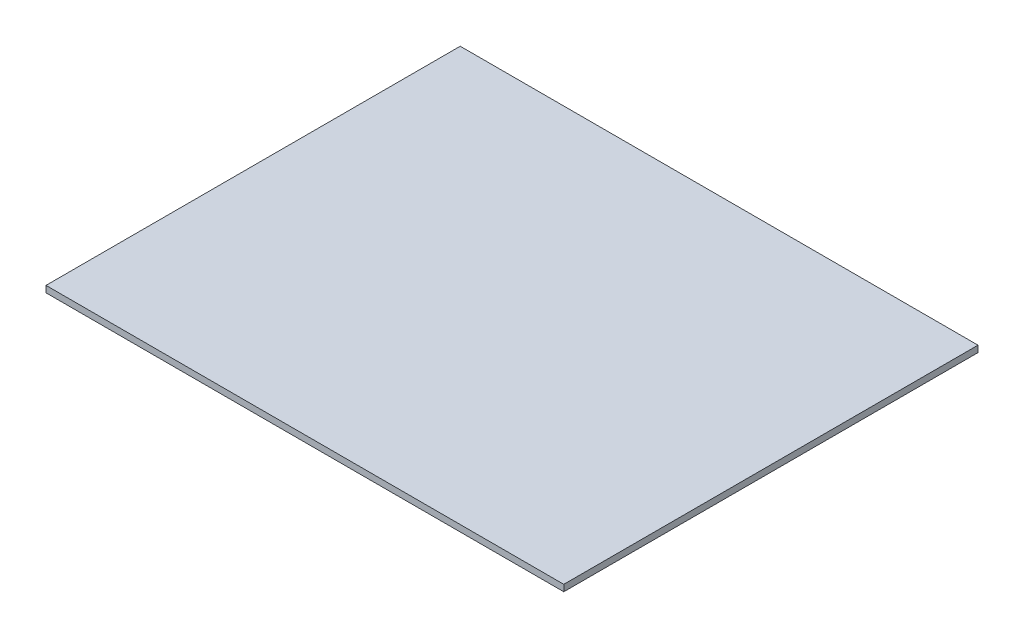
ISO-10303-21;
HEADER;
FILE_DESCRIPTION(('STEP AP214'),'2;1');
FILE_NAME('part.step','',(''),(''),'','','');
FILE_SCHEMA(('AUTOMOTIVE_DESIGN { 1 0 10303 214 1 1 1 1 }'));
ENDSEC;
DATA;
#1=APPLICATION_CONTEXT('core data for automotive mechanical design processes');
#2=APPLICATION_PROTOCOL_DEFINITION('international standard','automotive_design',2000,#1);
#3=PRODUCT_CONTEXT('',#1,'mechanical');
#4=PRODUCT('Part','Part','',(#3));
#5=PRODUCT_RELATED_PRODUCT_CATEGORY('part','',(#4));
#6=PRODUCT_DEFINITION_FORMATION('','',#4);
#7=PRODUCT_DEFINITION_CONTEXT('part definition',#1,'design');
#8=PRODUCT_DEFINITION('design','',#6,#7);
#9=PRODUCT_DEFINITION_SHAPE('','',#8);
#10=(LENGTH_UNIT() NAMED_UNIT(*) SI_UNIT(.MILLI.,.METRE.));
#11=(NAMED_UNIT(*) PLANE_ANGLE_UNIT() SI_UNIT($,.RADIAN.));
#12=(NAMED_UNIT(*) SI_UNIT($,.STERADIAN.) SOLID_ANGLE_UNIT());
#13=UNCERTAINTY_MEASURE_WITH_UNIT(LENGTH_MEASURE(1.E-05),#10,'distance_accuracy_value','');
#14=(GEOMETRIC_REPRESENTATION_CONTEXT(3) GLOBAL_UNCERTAINTY_ASSIGNED_CONTEXT((#13)) GLOBAL_UNIT_ASSIGNED_CONTEXT((#10,
#11,#12)) REPRESENTATION_CONTEXT('',''));
#15=CARTESIAN_POINT('',(0.,0.,0.));
#16=DIRECTION('',(0.,0.,1.));
#17=DIRECTION('',(1.,0.,0.));
#18=AXIS2_PLACEMENT_3D('',#15,#16,#17);
#19=CARTESIAN_POINT('',(0.,50.,0.));
#20=DIRECTION('',(1.,0.,0.));
#21=DIRECTION('',(0.,0.,-1.));
#22=AXIS2_PLACEMENT_3D('',#19,#20,#21);
#23=PLANE('',#22);
#24=DIRECTION('',(0.,0.,1.));
#25=VECTOR('',#24,1.);
#26=CARTESIAN_POINT('',(0.,0.,0.));
#27=LINE('',#26,#25);
#28=CARTESIAN_POINT('',(0.,0.,-3200.));
#29=VERTEX_POINT('',#28);
#30=CARTESIAN_POINT('',(0.,0.,0.));
#31=VERTEX_POINT('',#30);
#32=EDGE_CURVE('E98',#29,#31,#27,.T.);
#33=ORIENTED_EDGE('',*,*,#32,.T.);
#34=DIRECTION('',(0.,-1.,0.));
#35=VECTOR('',#34,1.);
#36=CARTESIAN_POINT('',(0.,50.,0.));
#37=LINE('',#36,#35);
#38=CARTESIAN_POINT('',(0.,50.,0.));
#39=VERTEX_POINT('',#38);
#40=EDGE_CURVE('E11',#39,#31,#37,.T.);
#41=ORIENTED_EDGE('',*,*,#40,.F.);
#42=DIRECTION('',(0.,0.,1.));
#43=VECTOR('',#42,1.);
#44=CARTESIAN_POINT('',(0.,50.,0.));
#45=LINE('',#44,#43);
#46=CARTESIAN_POINT('',(0.,50.,-3200.));
#47=VERTEX_POINT('',#46);
#48=EDGE_CURVE('E86',#47,#39,#45,.T.);
#49=ORIENTED_EDGE('',*,*,#48,.F.);
#50=DIRECTION('',(0.,-1.,0.));
#51=VECTOR('',#50,1.);
#52=CARTESIAN_POINT('',(0.,50.,-3200.));
#53=LINE('',#52,#51);
#54=EDGE_CURVE('E94',#47,#29,#53,.T.);
#55=ORIENTED_EDGE('',*,*,#54,.T.);
#56=EDGE_LOOP('',(#33,#41,#49,#55));
#57=FACE_BOUND('',#56,.T.);
#58=ADVANCED_FACE('F35',(#57),#23,.F.);
#59=CARTESIAN_POINT('',(0.,50.,0.));
#60=DIRECTION('',(0.,0.,-1.));
#61=DIRECTION('',(-1.,0.,0.));
#62=AXIS2_PLACEMENT_3D('',#59,#60,#61);
#63=PLANE('',#62);
#64=DIRECTION('',(1.,0.,0.));
#65=VECTOR('',#64,1.);
#66=CARTESIAN_POINT('',(0.,0.,0.));
#67=LINE('',#66,#65);
#68=CARTESIAN_POINT('',(4000.,0.,0.));
#69=VERTEX_POINT('',#68);
#70=EDGE_CURVE('E90',#31,#69,#67,.T.);
#71=ORIENTED_EDGE('',*,*,#70,.T.);
#72=DIRECTION('',(0.,-1.,0.));
#73=VECTOR('',#72,1.);
#74=CARTESIAN_POINT('',(4000.,50.,0.));
#75=LINE('',#74,#73);
#76=CARTESIAN_POINT('',(4000.,50.,0.));
#77=VERTEX_POINT('',#76);
#78=EDGE_CURVE('E43',#77,#69,#75,.T.);
#79=ORIENTED_EDGE('',*,*,#78,.F.);
#80=DIRECTION('',(1.,0.,0.));
#81=VECTOR('',#80,1.);
#82=CARTESIAN_POINT('',(0.,50.,0.));
#83=LINE('',#82,#81);
#84=EDGE_CURVE('E81',#39,#77,#83,.T.);
#85=ORIENTED_EDGE('',*,*,#84,.F.);
#86=ORIENTED_EDGE('',*,*,#40,.T.);
#87=EDGE_LOOP('',(#71,#79,#85,#86));
#88=FACE_BOUND('',#87,.T.);
#89=ADVANCED_FACE('F89',(#88),#63,.F.);
#90=CARTESIAN_POINT('',(4000.,50.,0.));
#91=DIRECTION('',(-1.,0.,0.));
#92=DIRECTION('',(0.,0.,1.));
#93=AXIS2_PLACEMENT_3D('',#90,#91,#92);
#94=PLANE('',#93);
#95=DIRECTION('',(0.,0.,-1.));
#96=VECTOR('',#95,1.);
#97=CARTESIAN_POINT('',(4000.,0.,0.));
#98=LINE('',#97,#96);
#99=CARTESIAN_POINT('',(4000.,0.,-3200.));
#100=VERTEX_POINT('',#99);
#101=EDGE_CURVE('E68',#69,#100,#98,.T.);
#102=ORIENTED_EDGE('',*,*,#101,.T.);
#103=DIRECTION('',(0.,-1.,0.));
#104=VECTOR('',#103,1.);
#105=CARTESIAN_POINT('',(4000.,50.,-3200.));
#106=LINE('',#105,#104);
#107=CARTESIAN_POINT('',(4000.,50.,-3200.));
#108=VERTEX_POINT('',#107);
#109=EDGE_CURVE('E91',#108,#100,#106,.T.);
#110=ORIENTED_EDGE('',*,*,#109,.F.);
#111=DIRECTION('',(0.,0.,-1.));
#112=VECTOR('',#111,1.);
#113=CARTESIAN_POINT('',(4000.,50.,0.));
#114=LINE('',#113,#112);
#115=EDGE_CURVE('E84',#77,#108,#114,.T.);
#116=ORIENTED_EDGE('',*,*,#115,.F.);
#117=ORIENTED_EDGE('',*,*,#78,.T.);
#118=EDGE_LOOP('',(#102,#110,#116,#117));
#119=FACE_BOUND('',#118,.T.);
#120=ADVANCED_FACE('F92',(#119),#94,.F.);
#121=CARTESIAN_POINT('',(0.,50.,-3200.));
#122=DIRECTION('',(0.,0.,1.));
#123=DIRECTION('',(1.,0.,0.));
#124=AXIS2_PLACEMENT_3D('',#121,#122,#123);
#125=PLANE('',#124);
#126=DIRECTION('',(-1.,0.,0.));
#127=VECTOR('',#126,1.);
#128=CARTESIAN_POINT('',(0.,0.,-3200.));
#129=LINE('',#128,#127);
#130=EDGE_CURVE('E74',#100,#29,#129,.T.);
#131=ORIENTED_EDGE('',*,*,#130,.T.);
#132=ORIENTED_EDGE('',*,*,#54,.F.);
#133=DIRECTION('',(-1.,0.,0.));
#134=VECTOR('',#133,1.);
#135=CARTESIAN_POINT('',(0.,50.,-3200.));
#136=LINE('',#135,#134);
#137=EDGE_CURVE('E51',#108,#47,#136,.T.);
#138=ORIENTED_EDGE('',*,*,#137,.F.);
#139=ORIENTED_EDGE('',*,*,#109,.T.);
#140=EDGE_LOOP('',(#131,#132,#138,#139));
#141=FACE_BOUND('',#140,.T.);
#142=ADVANCED_FACE('F105',(#141),#125,.F.);
#143=CARTESIAN_POINT('',(0.,50.,0.));
#144=DIRECTION('',(0.,-1.,0.));
#145=DIRECTION('',(0.,0.,-1.));
#146=AXIS2_PLACEMENT_3D('',#143,#144,#145);
#147=PLANE('',#146);
#148=ORIENTED_EDGE('',*,*,#48,.T.);
#149=ORIENTED_EDGE('',*,*,#84,.T.);
#150=ORIENTED_EDGE('',*,*,#115,.T.);
#151=ORIENTED_EDGE('',*,*,#137,.T.);
#152=EDGE_LOOP('',(#148,#149,#150,#151));
#153=FACE_BOUND('',#152,.T.);
#154=ADVANCED_FACE('F82',(#153),#147,.F.);
#155=CARTESIAN_POINT('',(0.,0.,0.));
#156=DIRECTION('',(0.,-1.,0.));
#157=DIRECTION('',(0.,0.,-1.));
#158=AXIS2_PLACEMENT_3D('',#155,#156,#157);
#159=PLANE('',#158);
#160=ORIENTED_EDGE('',*,*,#32,.F.);
#161=ORIENTED_EDGE('',*,*,#130,.F.);
#162=ORIENTED_EDGE('',*,*,#101,.F.);
#163=ORIENTED_EDGE('',*,*,#70,.F.);
#164=EDGE_LOOP('',(#160,#161,#162,#163));
#165=FACE_BOUND('',#164,.T.);
#166=ADVANCED_FACE('F108',(#165),#159,.T.);
#167=CLOSED_SHELL('',(#58,#89,#120,#142,#154,#166));
#168=MANIFOLD_SOLID_BREP('B2',#167);
#169=ADVANCED_BREP_SHAPE_REPRESENTATION('',(#18,#168),#14);
#170=SHAPE_DEFINITION_REPRESENTATION(#9,#169);
ENDSEC;
END-ISO-10303-21;
